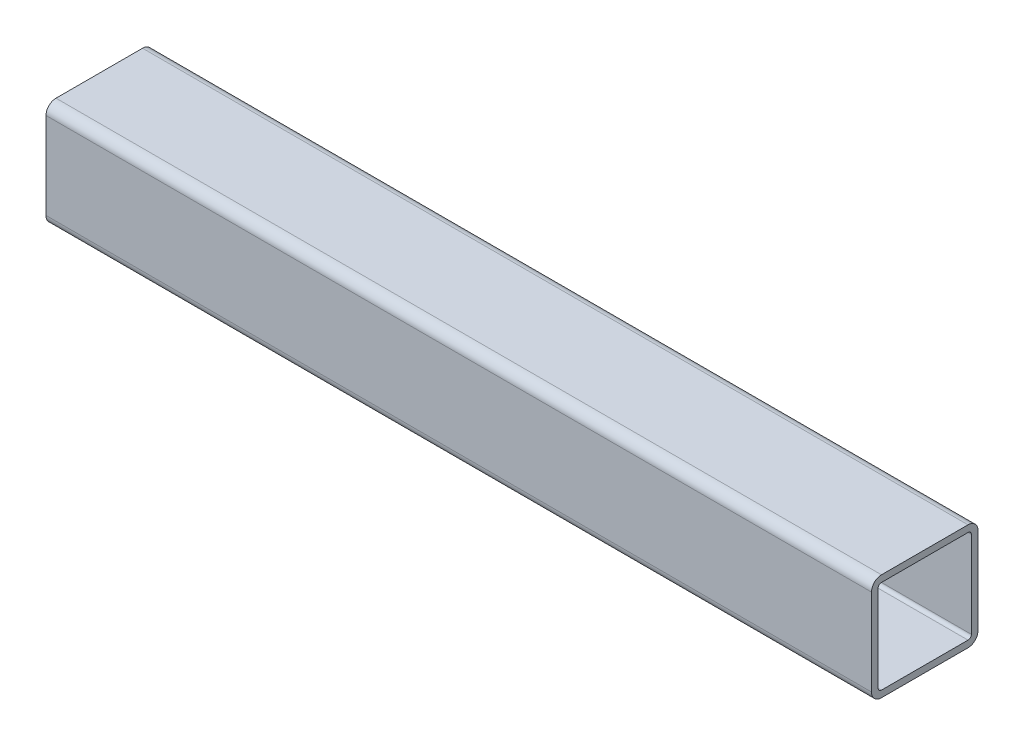
ISO-10303-21;
HEADER;
FILE_DESCRIPTION(('STEP AP214'),'2;1');
FILE_NAME('part.step','',(''),(''),'','','');
FILE_SCHEMA(('AUTOMOTIVE_DESIGN { 1 0 10303 214 1 1 1 1 }'));
ENDSEC;
DATA;
#1=APPLICATION_CONTEXT('core data for automotive mechanical design processes');
#2=APPLICATION_PROTOCOL_DEFINITION('international standard','automotive_design',2000,#1);
#3=PRODUCT_CONTEXT('',#1,'mechanical');
#4=PRODUCT('Part','Part','',(#3));
#5=PRODUCT_RELATED_PRODUCT_CATEGORY('part','',(#4));
#6=PRODUCT_DEFINITION_FORMATION('','',#4);
#7=PRODUCT_DEFINITION_CONTEXT('part definition',#1,'design');
#8=PRODUCT_DEFINITION('design','',#6,#7);
#9=PRODUCT_DEFINITION_SHAPE('','',#8);
#10=(LENGTH_UNIT() NAMED_UNIT(*) SI_UNIT(.MILLI.,.METRE.));
#11=(NAMED_UNIT(*) PLANE_ANGLE_UNIT() SI_UNIT($,.RADIAN.));
#12=(NAMED_UNIT(*) SI_UNIT($,.STERADIAN.) SOLID_ANGLE_UNIT());
#13=UNCERTAINTY_MEASURE_WITH_UNIT(LENGTH_MEASURE(1.E-05),#10,'distance_accuracy_value','');
#14=(GEOMETRIC_REPRESENTATION_CONTEXT(3) GLOBAL_UNCERTAINTY_ASSIGNED_CONTEXT((#13)) GLOBAL_UNIT_ASSIGNED_CONTEXT((#10,
#11,#12)) REPRESENTATION_CONTEXT('',''));
#15=CARTESIAN_POINT('',(0.,0.,0.));
#16=DIRECTION('',(0.,0.,1.));
#17=DIRECTION('',(1.,0.,0.));
#18=AXIS2_PLACEMENT_3D('',#15,#16,#17);
#19=CARTESIAN_POINT('',(196.85,-20.6375,-20.6375));
#20=DIRECTION('',(1.,0.,0.));
#21=DIRECTION('',(0.,0.,-1.));
#22=AXIS2_PLACEMENT_3D('',#19,#20,#21);
#23=PLANE('',#22);
#24=CARTESIAN_POINT('',(196.85,-20.6375,-20.6375));
#25=DIRECTION('',(1.,0.,0.));
#26=DIRECTION('',(0.,0.,-1.));
#27=AXIS2_PLACEMENT_3D('',#24,#25,#26);
#28=CIRCLE('',#27,4.7625);
#29=CARTESIAN_POINT('',(196.85,-25.4,-20.6375));
#30=VERTEX_POINT('',#29);
#31=CARTESIAN_POINT('',(196.85,-20.6375,-25.4));
#32=VERTEX_POINT('',#31);
#33=EDGE_CURVE('E211',#30,#32,#28,.T.);
#34=ORIENTED_EDGE('',*,*,#33,.T.);
#35=DIRECTION('',(0.,1.,0.));
#36=VECTOR('',#35,1.);
#37=CARTESIAN_POINT('',(196.85,-20.6375,-25.4));
#38=LINE('',#37,#36);
#39=CARTESIAN_POINT('',(196.85,20.6375,-25.4));
#40=VERTEX_POINT('',#39);
#41=EDGE_CURVE('E214',#32,#40,#38,.T.);
#42=ORIENTED_EDGE('',*,*,#41,.T.);
#43=CARTESIAN_POINT('',(196.85,20.6375,-20.6375));
#44=DIRECTION('',(1.,0.,0.));
#45=DIRECTION('',(0.,0.,-1.));
#46=AXIS2_PLACEMENT_3D('',#43,#44,#45);
#47=CIRCLE('',#46,4.7625);
#48=CARTESIAN_POINT('',(196.85,25.4,-20.6375));
#49=VERTEX_POINT('',#48);
#50=EDGE_CURVE('E217',#40,#49,#47,.T.);
#51=ORIENTED_EDGE('',*,*,#50,.T.);
#52=DIRECTION('',(0.,0.,1.));
#53=VECTOR('',#52,1.);
#54=CARTESIAN_POINT('',(196.85,25.4,20.6375));
#55=LINE('',#54,#53);
#56=CARTESIAN_POINT('',(196.85,25.4,20.6375));
#57=VERTEX_POINT('',#56);
#58=EDGE_CURVE('E219',#49,#57,#55,.T.);
#59=ORIENTED_EDGE('',*,*,#58,.T.);
#60=CARTESIAN_POINT('',(196.85,20.6375,20.6375));
#61=DIRECTION('',(1.,0.,0.));
#62=DIRECTION('',(0.,0.,-1.));
#63=AXIS2_PLACEMENT_3D('',#60,#61,#62);
#64=CIRCLE('',#63,4.7625);
#65=CARTESIAN_POINT('',(196.85,20.6375,25.4));
#66=VERTEX_POINT('',#65);
#67=EDGE_CURVE('E221',#57,#66,#64,.T.);
#68=ORIENTED_EDGE('',*,*,#67,.T.);
#69=DIRECTION('',(0.,-1.,0.));
#70=VECTOR('',#69,1.);
#71=CARTESIAN_POINT('',(196.85,-20.6375,25.4));
#72=LINE('',#71,#70);
#73=CARTESIAN_POINT('',(196.85,-20.6375,25.4));
#74=VERTEX_POINT('',#73);
#75=EDGE_CURVE('E223',#66,#74,#72,.T.);
#76=ORIENTED_EDGE('',*,*,#75,.T.);
#77=CARTESIAN_POINT('',(196.85,-20.6375,20.6375));
#78=DIRECTION('',(1.,0.,0.));
#79=DIRECTION('',(0.,0.,-1.));
#80=AXIS2_PLACEMENT_3D('',#77,#78,#79);
#81=CIRCLE('',#80,4.7625);
#82=CARTESIAN_POINT('',(196.85,-25.4,20.6375));
#83=VERTEX_POINT('',#82);
#84=EDGE_CURVE('E225',#74,#83,#81,.T.);
#85=ORIENTED_EDGE('',*,*,#84,.T.);
#86=DIRECTION('',(0.,0.,-1.));
#87=VECTOR('',#86,1.);
#88=CARTESIAN_POINT('',(196.85,-25.4,20.6375));
#89=LINE('',#88,#87);
#90=EDGE_CURVE('E227',#83,#30,#89,.T.);
#91=ORIENTED_EDGE('',*,*,#90,.T.);
#92=EDGE_LOOP('',(#34,#42,#51,#59,#68,#76,#85,#91));
#93=FACE_BOUND('',#92,.T.);
#94=DIRECTION('',(0.,1.,0.));
#95=VECTOR('',#94,1.);
#96=CARTESIAN_POINT('',(196.85,-20.6375,-22.225));
#97=LINE('',#96,#95);
#98=CARTESIAN_POINT('',(196.85,-20.6375,-22.225));
#99=VERTEX_POINT('',#98);
#100=CARTESIAN_POINT('',(196.85,20.6375,-22.225));
#101=VERTEX_POINT('',#100);
#102=EDGE_CURVE('E154',#99,#101,#97,.T.);
#103=ORIENTED_EDGE('',*,*,#102,.F.);
#104=CARTESIAN_POINT('',(196.85,-20.6375,-20.6375));
#105=DIRECTION('',(1.,0.,0.));
#106=DIRECTION('',(0.,0.,-1.));
#107=AXIS2_PLACEMENT_3D('',#104,#105,#106);
#108=CIRCLE('',#107,1.5875);
#109=CARTESIAN_POINT('',(196.85,-22.225,-20.6375));
#110=VERTEX_POINT('',#109);
#111=EDGE_CURVE('E146',#110,#99,#108,.T.);
#112=ORIENTED_EDGE('',*,*,#111,.F.);
#113=DIRECTION('',(0.,0.,-1.));
#114=VECTOR('',#113,1.);
#115=CARTESIAN_POINT('',(196.85,-22.225,20.6375));
#116=LINE('',#115,#114);
#117=CARTESIAN_POINT('',(196.85,-22.225,20.6375));
#118=VERTEX_POINT('',#117);
#119=EDGE_CURVE('E179',#118,#110,#116,.T.);
#120=ORIENTED_EDGE('',*,*,#119,.F.);
#121=CARTESIAN_POINT('',(196.85,-20.6375,20.6375));
#122=DIRECTION('',(1.,0.,0.));
#123=DIRECTION('',(0.,0.,-1.));
#124=AXIS2_PLACEMENT_3D('',#121,#122,#123);
#125=CIRCLE('',#124,1.5875);
#126=CARTESIAN_POINT('',(196.85,-20.6375,22.225));
#127=VERTEX_POINT('',#126);
#128=EDGE_CURVE('E177',#127,#118,#125,.T.);
#129=ORIENTED_EDGE('',*,*,#128,.F.);
#130=DIRECTION('',(0.,-1.,0.));
#131=VECTOR('',#130,1.);
#132=CARTESIAN_POINT('',(196.85,-20.6375,22.225));
#133=LINE('',#132,#131);
#134=CARTESIAN_POINT('',(196.85,20.6375,22.225));
#135=VERTEX_POINT('',#134);
#136=EDGE_CURVE('E175',#135,#127,#133,.T.);
#137=ORIENTED_EDGE('',*,*,#136,.F.);
#138=CARTESIAN_POINT('',(196.85,20.6375,20.6375));
#139=DIRECTION('',(1.,0.,0.));
#140=DIRECTION('',(0.,0.,-1.));
#141=AXIS2_PLACEMENT_3D('',#138,#139,#140);
#142=CIRCLE('',#141,1.5875);
#143=CARTESIAN_POINT('',(196.85,22.225,20.6375));
#144=VERTEX_POINT('',#143);
#145=EDGE_CURVE('E173',#144,#135,#142,.T.);
#146=ORIENTED_EDGE('',*,*,#145,.F.);
#147=DIRECTION('',(0.,0.,1.));
#148=VECTOR('',#147,1.);
#149=CARTESIAN_POINT('',(196.85,22.225,20.6375));
#150=LINE('',#149,#148);
#151=CARTESIAN_POINT('',(196.85,22.225,-20.6375));
#152=VERTEX_POINT('',#151);
#153=EDGE_CURVE('E169',#152,#144,#150,.T.);
#154=ORIENTED_EDGE('',*,*,#153,.F.);
#155=CARTESIAN_POINT('',(196.85,20.6375,-20.6375));
#156=DIRECTION('',(1.,0.,0.));
#157=DIRECTION('',(0.,0.,-1.));
#158=AXIS2_PLACEMENT_3D('',#155,#156,#157);
#159=CIRCLE('',#158,1.5875);
#160=EDGE_CURVE('E167',#101,#152,#159,.T.);
#161=ORIENTED_EDGE('',*,*,#160,.F.);
#162=EDGE_LOOP('',(#103,#112,#120,#129,#137,#146,#154,#161));
#163=FACE_BOUND('',#162,.T.);
#164=ADVANCED_FACE('F33',(#93,#163),#23,.T.);
#165=CARTESIAN_POINT('',(-196.85,-20.6375,-20.6375));
#166=DIRECTION('',(1.,0.,0.));
#167=DIRECTION('',(0.,0.,-1.));
#168=AXIS2_PLACEMENT_3D('',#165,#166,#167);
#169=PLANE('',#168);
#170=CARTESIAN_POINT('',(-196.85,-20.6375,-20.6375));
#171=DIRECTION('',(1.,0.,0.));
#172=DIRECTION('',(0.,0.,-1.));
#173=AXIS2_PLACEMENT_3D('',#170,#171,#172);
#174=CIRCLE('',#173,4.7625);
#175=CARTESIAN_POINT('',(-196.85,-25.4,-20.6375));
#176=VERTEX_POINT('',#175);
#177=CARTESIAN_POINT('',(-196.85,-20.6375,-25.4));
#178=VERTEX_POINT('',#177);
#179=EDGE_CURVE('E162',#176,#178,#174,.T.);
#180=ORIENTED_EDGE('',*,*,#179,.F.);
#181=DIRECTION('',(0.,0.,-1.));
#182=VECTOR('',#181,1.);
#183=CARTESIAN_POINT('',(-196.85,-25.4,20.6375));
#184=LINE('',#183,#182);
#185=CARTESIAN_POINT('',(-196.85,-25.4,20.6375));
#186=VERTEX_POINT('',#185);
#187=EDGE_CURVE('E215',#186,#176,#184,.T.);
#188=ORIENTED_EDGE('',*,*,#187,.F.);
#189=CARTESIAN_POINT('',(-196.85,-20.6375,20.6375));
#190=DIRECTION('',(1.,0.,0.));
#191=DIRECTION('',(0.,0.,-1.));
#192=AXIS2_PLACEMENT_3D('',#189,#190,#191);
#193=CIRCLE('',#192,4.7625);
#194=CARTESIAN_POINT('',(-196.85,-20.6375,25.4));
#195=VERTEX_POINT('',#194);
#196=EDGE_CURVE('E242',#195,#186,#193,.T.);
#197=ORIENTED_EDGE('',*,*,#196,.F.);
#198=DIRECTION('',(0.,-1.,0.));
#199=VECTOR('',#198,1.);
#200=CARTESIAN_POINT('',(-196.85,-20.6375,25.4));
#201=LINE('',#200,#199);
#202=CARTESIAN_POINT('',(-196.85,20.6375,25.4));
#203=VERTEX_POINT('',#202);
#204=EDGE_CURVE('E240',#203,#195,#201,.T.);
#205=ORIENTED_EDGE('',*,*,#204,.F.);
#206=CARTESIAN_POINT('',(-196.85,20.6375,20.6375));
#207=DIRECTION('',(1.,0.,0.));
#208=DIRECTION('',(0.,0.,-1.));
#209=AXIS2_PLACEMENT_3D('',#206,#207,#208);
#210=CIRCLE('',#209,4.7625);
#211=CARTESIAN_POINT('',(-196.85,25.4,20.6375));
#212=VERTEX_POINT('',#211);
#213=EDGE_CURVE('E238',#212,#203,#210,.T.);
#214=ORIENTED_EDGE('',*,*,#213,.F.);
#215=DIRECTION('',(0.,0.,1.));
#216=VECTOR('',#215,1.);
#217=CARTESIAN_POINT('',(-196.85,25.4,20.6375));
#218=LINE('',#217,#216);
#219=CARTESIAN_POINT('',(-196.85,25.4,-20.6375));
#220=VERTEX_POINT('',#219);
#221=EDGE_CURVE('E236',#220,#212,#218,.T.);
#222=ORIENTED_EDGE('',*,*,#221,.F.);
#223=CARTESIAN_POINT('',(-196.85,20.6375,-20.6375));
#224=DIRECTION('',(1.,0.,0.));
#225=DIRECTION('',(0.,0.,-1.));
#226=AXIS2_PLACEMENT_3D('',#223,#224,#225);
#227=CIRCLE('',#226,4.7625);
#228=CARTESIAN_POINT('',(-196.85,20.6375,-25.4));
#229=VERTEX_POINT('',#228);
#230=EDGE_CURVE('E234',#229,#220,#227,.T.);
#231=ORIENTED_EDGE('',*,*,#230,.F.);
#232=DIRECTION('',(0.,1.,0.));
#233=VECTOR('',#232,1.);
#234=CARTESIAN_POINT('',(-196.85,-20.6375,-25.4));
#235=LINE('',#234,#233);
#236=EDGE_CURVE('E232',#178,#229,#235,.T.);
#237=ORIENTED_EDGE('',*,*,#236,.F.);
#238=EDGE_LOOP('',(#180,#188,#197,#205,#214,#222,#231,#237));
#239=FACE_BOUND('',#238,.T.);
#240=CARTESIAN_POINT('',(-196.85,-20.6375,-20.6375));
#241=DIRECTION('',(1.,0.,0.));
#242=DIRECTION('',(0.,0.,-1.));
#243=AXIS2_PLACEMENT_3D('',#240,#241,#242);
#244=CIRCLE('',#243,1.5875);
#245=CARTESIAN_POINT('',(-196.85,-22.225,-20.6375));
#246=VERTEX_POINT('',#245);
#247=CARTESIAN_POINT('',(-196.85,-20.6375,-22.225));
#248=VERTEX_POINT('',#247);
#249=EDGE_CURVE('E56',#246,#248,#244,.T.);
#250=ORIENTED_EDGE('',*,*,#249,.T.);
#251=DIRECTION('',(0.,1.,0.));
#252=VECTOR('',#251,1.);
#253=CARTESIAN_POINT('',(-196.85,-20.6375,-22.225));
#254=LINE('',#253,#252);
#255=CARTESIAN_POINT('',(-196.85,20.6375,-22.225));
#256=VERTEX_POINT('',#255);
#257=EDGE_CURVE('E161',#248,#256,#254,.T.);
#258=ORIENTED_EDGE('',*,*,#257,.T.);
#259=CARTESIAN_POINT('',(-196.85,20.6375,-20.6375));
#260=DIRECTION('',(1.,0.,0.));
#261=DIRECTION('',(0.,0.,-1.));
#262=AXIS2_PLACEMENT_3D('',#259,#260,#261);
#263=CIRCLE('',#262,1.5875);
#264=CARTESIAN_POINT('',(-196.85,22.225,-20.6375));
#265=VERTEX_POINT('',#264);
#266=EDGE_CURVE('E183',#256,#265,#263,.T.);
#267=ORIENTED_EDGE('',*,*,#266,.T.);
#268=DIRECTION('',(0.,0.,1.));
#269=VECTOR('',#268,1.);
#270=CARTESIAN_POINT('',(-196.85,22.225,20.6375));
#271=LINE('',#270,#269);
#272=CARTESIAN_POINT('',(-196.85,22.225,20.6375));
#273=VERTEX_POINT('',#272);
#274=EDGE_CURVE('E186',#265,#273,#271,.T.);
#275=ORIENTED_EDGE('',*,*,#274,.T.);
#276=CARTESIAN_POINT('',(-196.85,20.6375,20.6375));
#277=DIRECTION('',(1.,0.,0.));
#278=DIRECTION('',(0.,0.,-1.));
#279=AXIS2_PLACEMENT_3D('',#276,#277,#278);
#280=CIRCLE('',#279,1.5875);
#281=CARTESIAN_POINT('',(-196.85,20.6375,22.225));
#282=VERTEX_POINT('',#281);
#283=EDGE_CURVE('E189',#273,#282,#280,.T.);
#284=ORIENTED_EDGE('',*,*,#283,.T.);
#285=DIRECTION('',(0.,-1.,0.));
#286=VECTOR('',#285,1.);
#287=CARTESIAN_POINT('',(-196.85,-20.6375,22.225));
#288=LINE('',#287,#286);
#289=CARTESIAN_POINT('',(-196.85,-20.6375,22.225));
#290=VERTEX_POINT('',#289);
#291=EDGE_CURVE('E192',#282,#290,#288,.T.);
#292=ORIENTED_EDGE('',*,*,#291,.T.);
#293=CARTESIAN_POINT('',(-196.85,-20.6375,20.6375));
#294=DIRECTION('',(1.,0.,0.));
#295=DIRECTION('',(0.,0.,-1.));
#296=AXIS2_PLACEMENT_3D('',#293,#294,#295);
#297=CIRCLE('',#296,1.5875);
#298=CARTESIAN_POINT('',(-196.85,-22.225,20.6375));
#299=VERTEX_POINT('',#298);
#300=EDGE_CURVE('E195',#290,#299,#297,.T.);
#301=ORIENTED_EDGE('',*,*,#300,.T.);
#302=DIRECTION('',(0.,0.,-1.));
#303=VECTOR('',#302,1.);
#304=CARTESIAN_POINT('',(-196.85,-22.225,20.6375));
#305=LINE('',#304,#303);
#306=EDGE_CURVE('E155',#299,#246,#305,.T.);
#307=ORIENTED_EDGE('',*,*,#306,.T.);
#308=EDGE_LOOP('',(#250,#258,#267,#275,#284,#292,#301,#307));
#309=FACE_BOUND('',#308,.T.);
#310=ADVANCED_FACE('F272',(#239,#309),#169,.F.);
#311=CARTESIAN_POINT('',(196.85,-20.6375,-20.6375));
#312=DIRECTION('',(-1.,0.,0.));
#313=DIRECTION('',(0.,0.,1.));
#314=AXIS2_PLACEMENT_3D('',#311,#312,#313);
#315=CYLINDRICAL_SURFACE('',#314,4.7625);
#316=ORIENTED_EDGE('',*,*,#179,.T.);
#317=DIRECTION('',(-1.,0.,0.));
#318=VECTOR('',#317,1.);
#319=CARTESIAN_POINT('',(196.85,-20.6375,-25.4));
#320=LINE('',#319,#318);
#321=EDGE_CURVE('E11',#32,#178,#320,.T.);
#322=ORIENTED_EDGE('',*,*,#321,.F.);
#323=ORIENTED_EDGE('',*,*,#33,.F.);
#324=DIRECTION('',(-1.,0.,0.));
#325=VECTOR('',#324,1.);
#326=CARTESIAN_POINT('',(196.85,-25.4,-20.6375));
#327=LINE('',#326,#325);
#328=EDGE_CURVE('E229',#30,#176,#327,.T.);
#329=ORIENTED_EDGE('',*,*,#328,.T.);
#330=EDGE_LOOP('',(#316,#322,#323,#329));
#331=FACE_BOUND('',#330,.T.);
#332=ADVANCED_FACE('F35',(#331),#315,.T.);
#333=CARTESIAN_POINT('',(196.85,-20.6375,-25.4));
#334=DIRECTION('',(0.,0.,1.));
#335=DIRECTION('',(0.,-1.,0.));
#336=AXIS2_PLACEMENT_3D('',#333,#334,#335);
#337=PLANE('',#336);
#338=ORIENTED_EDGE('',*,*,#236,.T.);
#339=DIRECTION('',(-1.,0.,0.));
#340=VECTOR('',#339,1.);
#341=CARTESIAN_POINT('',(196.85,20.6375,-25.4));
#342=LINE('',#341,#340);
#343=EDGE_CURVE('E41',#40,#229,#342,.T.);
#344=ORIENTED_EDGE('',*,*,#343,.F.);
#345=ORIENTED_EDGE('',*,*,#41,.F.);
#346=ORIENTED_EDGE('',*,*,#321,.T.);
#347=EDGE_LOOP('',(#338,#344,#345,#346));
#348=FACE_BOUND('',#347,.T.);
#349=ADVANCED_FACE('F289',(#348),#337,.F.);
#350=CARTESIAN_POINT('',(196.85,20.6375,-20.6375));
#351=DIRECTION('',(-1.,0.,0.));
#352=DIRECTION('',(0.,0.,1.));
#353=AXIS2_PLACEMENT_3D('',#350,#351,#352);
#354=CYLINDRICAL_SURFACE('',#353,4.7625);
#355=ORIENTED_EDGE('',*,*,#230,.T.);
#356=DIRECTION('',(-1.,0.,0.));
#357=VECTOR('',#356,1.);
#358=CARTESIAN_POINT('',(196.85,25.4,-20.6375));
#359=LINE('',#358,#357);
#360=EDGE_CURVE('E259',#49,#220,#359,.T.);
#361=ORIENTED_EDGE('',*,*,#360,.F.);
#362=ORIENTED_EDGE('',*,*,#50,.F.);
#363=ORIENTED_EDGE('',*,*,#343,.T.);
#364=EDGE_LOOP('',(#355,#361,#362,#363));
#365=FACE_BOUND('',#364,.T.);
#366=ADVANCED_FACE('F266',(#365),#354,.T.);
#367=CARTESIAN_POINT('',(196.85,25.4,20.6375));
#368=DIRECTION('',(0.,-1.,0.));
#369=DIRECTION('',(0.,0.,-1.));
#370=AXIS2_PLACEMENT_3D('',#367,#368,#369);
#371=PLANE('',#370);
#372=ORIENTED_EDGE('',*,*,#221,.T.);
#373=DIRECTION('',(-1.,0.,0.));
#374=VECTOR('',#373,1.);
#375=CARTESIAN_POINT('',(196.85,25.4,20.6375));
#376=LINE('',#375,#374);
#377=EDGE_CURVE('E256',#57,#212,#376,.T.);
#378=ORIENTED_EDGE('',*,*,#377,.F.);
#379=ORIENTED_EDGE('',*,*,#58,.F.);
#380=ORIENTED_EDGE('',*,*,#360,.T.);
#381=EDGE_LOOP('',(#372,#378,#379,#380));
#382=FACE_BOUND('',#381,.T.);
#383=ADVANCED_FACE('F278',(#382),#371,.F.);
#384=CARTESIAN_POINT('',(196.85,20.6375,20.6375));
#385=DIRECTION('',(-1.,0.,0.));
#386=DIRECTION('',(0.,0.,1.));
#387=AXIS2_PLACEMENT_3D('',#384,#385,#386);
#388=CYLINDRICAL_SURFACE('',#387,4.7625);
#389=ORIENTED_EDGE('',*,*,#213,.T.);
#390=DIRECTION('',(-1.,0.,0.));
#391=VECTOR('',#390,1.);
#392=CARTESIAN_POINT('',(196.85,20.6375,25.4));
#393=LINE('',#392,#391);
#394=EDGE_CURVE('E253',#66,#203,#393,.T.);
#395=ORIENTED_EDGE('',*,*,#394,.F.);
#396=ORIENTED_EDGE('',*,*,#67,.F.);
#397=ORIENTED_EDGE('',*,*,#377,.T.);
#398=EDGE_LOOP('',(#389,#395,#396,#397));
#399=FACE_BOUND('',#398,.T.);
#400=ADVANCED_FACE('F282',(#399),#388,.T.);
#401=CARTESIAN_POINT('',(196.85,-20.6375,25.4));
#402=DIRECTION('',(0.,0.,-1.));
#403=DIRECTION('',(0.,1.,0.));
#404=AXIS2_PLACEMENT_3D('',#401,#402,#403);
#405=PLANE('',#404);
#406=ORIENTED_EDGE('',*,*,#204,.T.);
#407=DIRECTION('',(-1.,0.,0.));
#408=VECTOR('',#407,1.);
#409=CARTESIAN_POINT('',(196.85,-20.6375,25.4));
#410=LINE('',#409,#408);
#411=EDGE_CURVE('E250',#74,#195,#410,.T.);
#412=ORIENTED_EDGE('',*,*,#411,.F.);
#413=ORIENTED_EDGE('',*,*,#75,.F.);
#414=ORIENTED_EDGE('',*,*,#394,.T.);
#415=EDGE_LOOP('',(#406,#412,#413,#414));
#416=FACE_BOUND('',#415,.T.);
#417=ADVANCED_FACE('F302',(#416),#405,.F.);
#418=CARTESIAN_POINT('',(196.85,-20.6375,20.6375));
#419=DIRECTION('',(-1.,0.,0.));
#420=DIRECTION('',(0.,0.,1.));
#421=AXIS2_PLACEMENT_3D('',#418,#419,#420);
#422=CYLINDRICAL_SURFACE('',#421,4.7625);
#423=ORIENTED_EDGE('',*,*,#196,.T.);
#424=DIRECTION('',(-1.,0.,0.));
#425=VECTOR('',#424,1.);
#426=CARTESIAN_POINT('',(196.85,-25.4,20.6375));
#427=LINE('',#426,#425);
#428=EDGE_CURVE('E247',#83,#186,#427,.T.);
#429=ORIENTED_EDGE('',*,*,#428,.F.);
#430=ORIENTED_EDGE('',*,*,#84,.F.);
#431=ORIENTED_EDGE('',*,*,#411,.T.);
#432=EDGE_LOOP('',(#423,#429,#430,#431));
#433=FACE_BOUND('',#432,.T.);
#434=ADVANCED_FACE('F300',(#433),#422,.T.);
#435=CARTESIAN_POINT('',(196.85,-25.4,20.6375));
#436=DIRECTION('',(0.,1.,0.));
#437=DIRECTION('',(0.,0.,1.));
#438=AXIS2_PLACEMENT_3D('',#435,#436,#437);
#439=PLANE('',#438);
#440=ORIENTED_EDGE('',*,*,#187,.T.);
#441=ORIENTED_EDGE('',*,*,#328,.F.);
#442=ORIENTED_EDGE('',*,*,#90,.F.);
#443=ORIENTED_EDGE('',*,*,#428,.T.);
#444=EDGE_LOOP('',(#440,#441,#442,#443));
#445=FACE_BOUND('',#444,.T.);
#446=ADVANCED_FACE('F295',(#445),#439,.F.);
#447=CARTESIAN_POINT('',(196.85,-20.6375,-20.6375));
#448=DIRECTION('',(-1.,0.,0.));
#449=DIRECTION('',(0.,0.,1.));
#450=AXIS2_PLACEMENT_3D('',#447,#448,#449);
#451=CYLINDRICAL_SURFACE('',#450,1.5875);
#452=ORIENTED_EDGE('',*,*,#249,.F.);
#453=DIRECTION('',(-1.,0.,0.));
#454=VECTOR('',#453,1.);
#455=CARTESIAN_POINT('',(196.85,-22.225,-20.6375));
#456=LINE('',#455,#454);
#457=EDGE_CURVE('E150',#110,#246,#456,.T.);
#458=ORIENTED_EDGE('',*,*,#457,.F.);
#459=ORIENTED_EDGE('',*,*,#111,.T.);
#460=DIRECTION('',(-1.,0.,0.));
#461=VECTOR('',#460,1.);
#462=CARTESIAN_POINT('',(196.85,-20.6375,-22.225));
#463=LINE('',#462,#461);
#464=EDGE_CURVE('E149',#99,#248,#463,.T.);
#465=ORIENTED_EDGE('',*,*,#464,.T.);
#466=EDGE_LOOP('',(#452,#458,#459,#465));
#467=FACE_BOUND('',#466,.T.);
#468=ADVANCED_FACE('F148',(#467),#451,.F.);
#469=CARTESIAN_POINT('',(196.85,-20.6375,-22.225));
#470=DIRECTION('',(0.,0.,1.));
#471=DIRECTION('',(1.,0.,0.));
#472=AXIS2_PLACEMENT_3D('',#469,#470,#471);
#473=PLANE('',#472);
#474=ORIENTED_EDGE('',*,*,#257,.F.);
#475=ORIENTED_EDGE('',*,*,#464,.F.);
#476=ORIENTED_EDGE('',*,*,#102,.T.);
#477=DIRECTION('',(-1.,0.,0.));
#478=VECTOR('',#477,1.);
#479=CARTESIAN_POINT('',(196.85,20.6375,-22.225));
#480=LINE('',#479,#478);
#481=EDGE_CURVE('E163',#101,#256,#480,.T.);
#482=ORIENTED_EDGE('',*,*,#481,.T.);
#483=EDGE_LOOP('',(#474,#475,#476,#482));
#484=FACE_BOUND('',#483,.T.);
#485=ADVANCED_FACE('F158',(#484),#473,.T.);
#486=CARTESIAN_POINT('',(196.85,20.6375,-20.6375));
#487=DIRECTION('',(-1.,0.,0.));
#488=DIRECTION('',(0.,0.,1.));
#489=AXIS2_PLACEMENT_3D('',#486,#487,#488);
#490=CYLINDRICAL_SURFACE('',#489,1.5875);
#491=ORIENTED_EDGE('',*,*,#266,.F.);
#492=ORIENTED_EDGE('',*,*,#481,.F.);
#493=ORIENTED_EDGE('',*,*,#160,.T.);
#494=DIRECTION('',(-1.,0.,0.));
#495=VECTOR('',#494,1.);
#496=CARTESIAN_POINT('',(196.85,22.225,-20.6375));
#497=LINE('',#496,#495);
#498=EDGE_CURVE('E208',#152,#265,#497,.T.);
#499=ORIENTED_EDGE('',*,*,#498,.T.);
#500=EDGE_LOOP('',(#491,#492,#493,#499));
#501=FACE_BOUND('',#500,.T.);
#502=ADVANCED_FACE('F327',(#501),#490,.F.);
#503=CARTESIAN_POINT('',(196.85,22.225,20.6375));
#504=DIRECTION('',(0.,-1.,0.));
#505=DIRECTION('',(0.,0.,-1.));
#506=AXIS2_PLACEMENT_3D('',#503,#504,#505);
#507=PLANE('',#506);
#508=ORIENTED_EDGE('',*,*,#274,.F.);
#509=ORIENTED_EDGE('',*,*,#498,.F.);
#510=ORIENTED_EDGE('',*,*,#153,.T.);
#511=DIRECTION('',(-1.,0.,0.));
#512=VECTOR('',#511,1.);
#513=CARTESIAN_POINT('',(196.85,22.225,20.6375));
#514=LINE('',#513,#512);
#515=EDGE_CURVE('E206',#144,#273,#514,.T.);
#516=ORIENTED_EDGE('',*,*,#515,.T.);
#517=EDGE_LOOP('',(#508,#509,#510,#516));
#518=FACE_BOUND('',#517,.T.);
#519=ADVANCED_FACE('F331',(#518),#507,.T.);
#520=CARTESIAN_POINT('',(196.85,20.6375,20.6375));
#521=DIRECTION('',(-1.,0.,0.));
#522=DIRECTION('',(0.,0.,1.));
#523=AXIS2_PLACEMENT_3D('',#520,#521,#522);
#524=CYLINDRICAL_SURFACE('',#523,1.5875);
#525=ORIENTED_EDGE('',*,*,#283,.F.);
#526=ORIENTED_EDGE('',*,*,#515,.F.);
#527=ORIENTED_EDGE('',*,*,#145,.T.);
#528=DIRECTION('',(-1.,0.,0.));
#529=VECTOR('',#528,1.);
#530=CARTESIAN_POINT('',(196.85,20.6375,22.225));
#531=LINE('',#530,#529);
#532=EDGE_CURVE('E204',#135,#282,#531,.T.);
#533=ORIENTED_EDGE('',*,*,#532,.T.);
#534=EDGE_LOOP('',(#525,#526,#527,#533));
#535=FACE_BOUND('',#534,.T.);
#536=ADVANCED_FACE('F337',(#535),#524,.F.);
#537=CARTESIAN_POINT('',(196.85,-20.6375,22.225));
#538=DIRECTION('',(0.,0.,-1.));
#539=DIRECTION('',(-1.,0.,0.));
#540=AXIS2_PLACEMENT_3D('',#537,#538,#539);
#541=PLANE('',#540);
#542=ORIENTED_EDGE('',*,*,#291,.F.);
#543=ORIENTED_EDGE('',*,*,#532,.F.);
#544=ORIENTED_EDGE('',*,*,#136,.T.);
#545=DIRECTION('',(-1.,0.,0.));
#546=VECTOR('',#545,1.);
#547=CARTESIAN_POINT('',(196.85,-20.6375,22.225));
#548=LINE('',#547,#546);
#549=EDGE_CURVE('E202',#127,#290,#548,.T.);
#550=ORIENTED_EDGE('',*,*,#549,.T.);
#551=EDGE_LOOP('',(#542,#543,#544,#550));
#552=FACE_BOUND('',#551,.T.);
#553=ADVANCED_FACE('F341',(#552),#541,.T.);
#554=CARTESIAN_POINT('',(196.85,-20.6375,20.6375));
#555=DIRECTION('',(-1.,0.,0.));
#556=DIRECTION('',(0.,0.,1.));
#557=AXIS2_PLACEMENT_3D('',#554,#555,#556);
#558=CYLINDRICAL_SURFACE('',#557,1.5875);
#559=ORIENTED_EDGE('',*,*,#300,.F.);
#560=ORIENTED_EDGE('',*,*,#549,.F.);
#561=ORIENTED_EDGE('',*,*,#128,.T.);
#562=DIRECTION('',(-1.,0.,0.));
#563=VECTOR('',#562,1.);
#564=CARTESIAN_POINT('',(196.85,-22.225,20.6375));
#565=LINE('',#564,#563);
#566=EDGE_CURVE('E48',#118,#299,#565,.T.);
#567=ORIENTED_EDGE('',*,*,#566,.T.);
#568=EDGE_LOOP('',(#559,#560,#561,#567));
#569=FACE_BOUND('',#568,.T.);
#570=ADVANCED_FACE('F345',(#569),#558,.F.);
#571=CARTESIAN_POINT('',(196.85,-22.225,20.6375));
#572=DIRECTION('',(0.,1.,0.));
#573=DIRECTION('',(0.,0.,1.));
#574=AXIS2_PLACEMENT_3D('',#571,#572,#573);
#575=PLANE('',#574);
#576=ORIENTED_EDGE('',*,*,#306,.F.);
#577=ORIENTED_EDGE('',*,*,#566,.F.);
#578=ORIENTED_EDGE('',*,*,#119,.T.);
#579=ORIENTED_EDGE('',*,*,#457,.T.);
#580=EDGE_LOOP('',(#576,#577,#578,#579));
#581=FACE_BOUND('',#580,.T.);
#582=ADVANCED_FACE('F349',(#581),#575,.T.);
#583=CLOSED_SHELL('',(#164,#310,#332,#349,#366,#383,#400,#417,#434,#446,#468,#485,#502,#519,
#536,#553,#570,#582));
#584=MANIFOLD_SOLID_BREP('B2',#583);
#585=ADVANCED_BREP_SHAPE_REPRESENTATION('',(#18,#584),#14);
#586=SHAPE_DEFINITION_REPRESENTATION(#9,#585);
ENDSEC;
END-ISO-10303-21;
